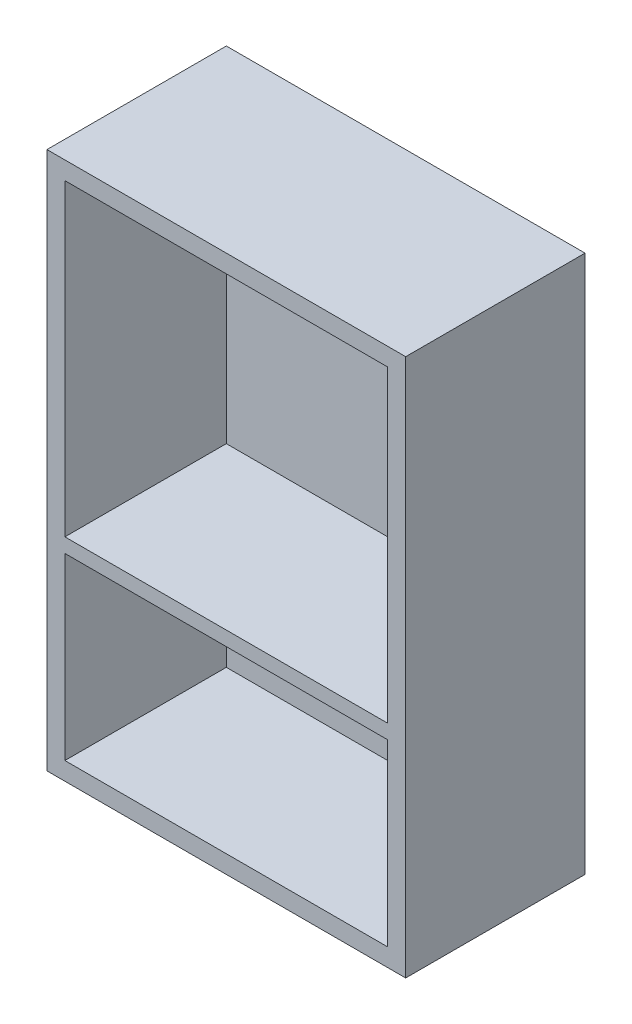
ISO-10303-21;
HEADER;
FILE_DESCRIPTION(('STEP AP214'),'2;1');
FILE_NAME('part.step','',(''),(''),'','','');
FILE_SCHEMA(('AUTOMOTIVE_DESIGN { 1 0 10303 214 1 1 1 1 }'));
ENDSEC;
DATA;
#1=APPLICATION_CONTEXT('core data for automotive mechanical design processes');
#2=APPLICATION_PROTOCOL_DEFINITION('international standard','automotive_design',2000,#1);
#3=PRODUCT_CONTEXT('',#1,'mechanical');
#4=PRODUCT('Part','Part','',(#3));
#5=PRODUCT_RELATED_PRODUCT_CATEGORY('part','',(#4));
#6=PRODUCT_DEFINITION_FORMATION('','',#4);
#7=PRODUCT_DEFINITION_CONTEXT('part definition',#1,'design');
#8=PRODUCT_DEFINITION('design','',#6,#7);
#9=PRODUCT_DEFINITION_SHAPE('','',#8);
#10=(LENGTH_UNIT() NAMED_UNIT(*) SI_UNIT(.MILLI.,.METRE.));
#11=(NAMED_UNIT(*) PLANE_ANGLE_UNIT() SI_UNIT($,.RADIAN.));
#12=(NAMED_UNIT(*) SI_UNIT($,.STERADIAN.) SOLID_ANGLE_UNIT());
#13=UNCERTAINTY_MEASURE_WITH_UNIT(LENGTH_MEASURE(1.E-05),#10,'distance_accuracy_value','');
#14=(GEOMETRIC_REPRESENTATION_CONTEXT(3) GLOBAL_UNCERTAINTY_ASSIGNED_CONTEXT((#13)) GLOBAL_UNIT_ASSIGNED_CONTEXT((#10,
#11,#12)) REPRESENTATION_CONTEXT('',''));
#15=CARTESIAN_POINT('',(0.,0.,0.));
#16=DIRECTION('',(0.,0.,1.));
#17=DIRECTION('',(1.,0.,0.));
#18=AXIS2_PLACEMENT_3D('',#15,#16,#17);
#19=CARTESIAN_POINT('',(50.,75.,5.));
#20=DIRECTION('',(-1.,0.,0.));
#21=DIRECTION('',(0.,-1.,0.));
#22=AXIS2_PLACEMENT_3D('',#19,#20,#21);
#23=PLANE('',#22);
#24=DIRECTION('',(0.,1.,0.));
#25=VECTOR('',#24,1.);
#26=CARTESIAN_POINT('',(50.,75.,0.));
#27=LINE('',#26,#25);
#28=CARTESIAN_POINT('',(50.,-75.,0.));
#29=VERTEX_POINT('',#28);
#30=CARTESIAN_POINT('',(50.,75.,0.));
#31=VERTEX_POINT('',#30);
#32=EDGE_CURVE('E198',#29,#31,#27,.T.);
#33=ORIENTED_EDGE('',*,*,#32,.T.);
#34=DIRECTION('',(0.,0.,-1.));
#35=VECTOR('',#34,1.);
#36=CARTESIAN_POINT('',(50.,75.,5.));
#37=LINE('',#36,#35);
#38=CARTESIAN_POINT('',(50.,75.,50.));
#39=VERTEX_POINT('',#38);
#40=EDGE_CURVE('E11',#39,#31,#37,.T.);
#41=ORIENTED_EDGE('',*,*,#40,.F.);
#42=DIRECTION('',(0.,1.,0.));
#43=VECTOR('',#42,1.);
#44=CARTESIAN_POINT('',(50.,-75.,50.));
#45=LINE('',#44,#43);
#46=CARTESIAN_POINT('',(50.,-75.,50.));
#47=VERTEX_POINT('',#46);
#48=EDGE_CURVE('E186',#47,#39,#45,.T.);
#49=ORIENTED_EDGE('',*,*,#48,.F.);
#50=DIRECTION('',(0.,0.,-1.));
#51=VECTOR('',#50,1.);
#52=CARTESIAN_POINT('',(50.,-75.,5.));
#53=LINE('',#52,#51);
#54=EDGE_CURVE('E207',#47,#29,#53,.T.);
#55=ORIENTED_EDGE('',*,*,#54,.T.);
#56=EDGE_LOOP('',(#33,#41,#49,#55));
#57=FACE_BOUND('',#56,.T.);
#58=ADVANCED_FACE('F32',(#57),#23,.F.);
#59=CARTESIAN_POINT('',(-50.,75.,5.));
#60=DIRECTION('',(0.,-1.,0.));
#61=DIRECTION('',(0.,0.,-1.));
#62=AXIS2_PLACEMENT_3D('',#59,#60,#61);
#63=PLANE('',#62);
#64=DIRECTION('',(-1.,0.,0.));
#65=VECTOR('',#64,1.);
#66=CARTESIAN_POINT('',(-50.,75.,0.));
#67=LINE('',#66,#65);
#68=CARTESIAN_POINT('',(-50.,75.,0.));
#69=VERTEX_POINT('',#68);
#70=EDGE_CURVE('E201',#31,#69,#67,.T.);
#71=ORIENTED_EDGE('',*,*,#70,.T.);
#72=DIRECTION('',(0.,0.,-1.));
#73=VECTOR('',#72,1.);
#74=CARTESIAN_POINT('',(-50.,75.,5.));
#75=LINE('',#74,#73);
#76=CARTESIAN_POINT('',(-50.,75.,50.));
#77=VERTEX_POINT('',#76);
#78=EDGE_CURVE('E39',#77,#69,#75,.T.);
#79=ORIENTED_EDGE('',*,*,#78,.F.);
#80=DIRECTION('',(-1.,0.,0.));
#81=VECTOR('',#80,1.);
#82=CARTESIAN_POINT('',(-50.,75.,50.));
#83=LINE('',#82,#81);
#84=EDGE_CURVE('E189',#39,#77,#83,.T.);
#85=ORIENTED_EDGE('',*,*,#84,.F.);
#86=ORIENTED_EDGE('',*,*,#40,.T.);
#87=EDGE_LOOP('',(#71,#79,#85,#86));
#88=FACE_BOUND('',#87,.T.);
#89=ADVANCED_FACE('F229',(#88),#63,.F.);
#90=CARTESIAN_POINT('',(-50.,75.,5.));
#91=DIRECTION('',(1.,0.,0.));
#92=DIRECTION('',(0.,1.,0.));
#93=AXIS2_PLACEMENT_3D('',#90,#91,#92);
#94=PLANE('',#93);
#95=DIRECTION('',(0.,-1.,0.));
#96=VECTOR('',#95,1.);
#97=CARTESIAN_POINT('',(-50.,75.,0.));
#98=LINE('',#97,#96);
#99=CARTESIAN_POINT('',(-50.,-75.,0.));
#100=VERTEX_POINT('',#99);
#101=EDGE_CURVE('E203',#69,#100,#98,.T.);
#102=ORIENTED_EDGE('',*,*,#101,.T.);
#103=DIRECTION('',(0.,0.,-1.));
#104=VECTOR('',#103,1.);
#105=CARTESIAN_POINT('',(-50.,-75.,5.));
#106=LINE('',#105,#104);
#107=CARTESIAN_POINT('',(-50.,-75.,50.));
#108=VERTEX_POINT('',#107);
#109=EDGE_CURVE('E210',#108,#100,#106,.T.);
#110=ORIENTED_EDGE('',*,*,#109,.F.);
#111=DIRECTION('',(0.,-1.,0.));
#112=VECTOR('',#111,1.);
#113=CARTESIAN_POINT('',(-50.,-75.,50.));
#114=LINE('',#113,#112);
#115=EDGE_CURVE('E192',#77,#108,#114,.T.);
#116=ORIENTED_EDGE('',*,*,#115,.F.);
#117=ORIENTED_EDGE('',*,*,#78,.T.);
#118=EDGE_LOOP('',(#102,#110,#116,#117));
#119=FACE_BOUND('',#118,.T.);
#120=ADVANCED_FACE('F216',(#119),#94,.F.);
#121=CARTESIAN_POINT('',(-50.,-75.,5.));
#122=DIRECTION('',(0.,1.,0.));
#123=DIRECTION('',(0.,0.,1.));
#124=AXIS2_PLACEMENT_3D('',#121,#122,#123);
#125=PLANE('',#124);
#126=DIRECTION('',(1.,0.,0.));
#127=VECTOR('',#126,1.);
#128=CARTESIAN_POINT('',(-50.,-75.,0.));
#129=LINE('',#128,#127);
#130=EDGE_CURVE('E205',#100,#29,#129,.T.);
#131=ORIENTED_EDGE('',*,*,#130,.T.);
#132=ORIENTED_EDGE('',*,*,#54,.F.);
#133=DIRECTION('',(1.,0.,0.));
#134=VECTOR('',#133,1.);
#135=CARTESIAN_POINT('',(-50.,-75.,50.));
#136=LINE('',#135,#134);
#137=EDGE_CURVE('E195',#108,#47,#136,.T.);
#138=ORIENTED_EDGE('',*,*,#137,.F.);
#139=ORIENTED_EDGE('',*,*,#109,.T.);
#140=EDGE_LOOP('',(#131,#132,#138,#139));
#141=FACE_BOUND('',#140,.T.);
#142=ADVANCED_FACE('F224',(#141),#125,.F.);
#143=CARTESIAN_POINT('',(0.,0.,0.));
#144=DIRECTION('',(0.,0.,1.));
#145=DIRECTION('',(1.,0.,0.));
#146=AXIS2_PLACEMENT_3D('',#143,#144,#145);
#147=PLANE('',#146);
#148=ORIENTED_EDGE('',*,*,#32,.F.);
#149=ORIENTED_EDGE('',*,*,#130,.F.);
#150=ORIENTED_EDGE('',*,*,#101,.F.);
#151=ORIENTED_EDGE('',*,*,#70,.F.);
#152=EDGE_LOOP('',(#148,#149,#150,#151));
#153=FACE_BOUND('',#152,.T.);
#154=ADVANCED_FACE('F222',(#153),#147,.F.);
#155=CARTESIAN_POINT('',(0.,0.,50.));
#156=DIRECTION('',(0.,0.,-1.));
#157=DIRECTION('',(-1.,0.,0.));
#158=AXIS2_PLACEMENT_3D('',#155,#156,#157);
#159=PLANE('',#158);
#160=DIRECTION('',(0.,1.,0.));
#161=VECTOR('',#160,1.);
#162=CARTESIAN_POINT('',(45.,70.,50.));
#163=LINE('',#162,#161);
#164=CARTESIAN_POINT('',(45.,-16.,50.));
#165=VERTEX_POINT('',#164);
#166=CARTESIAN_POINT('',(45.,70.,50.));
#167=VERTEX_POINT('',#166);
#168=EDGE_CURVE('E160',#165,#167,#163,.T.);
#169=ORIENTED_EDGE('',*,*,#168,.F.);
#170=DIRECTION('',(1.,0.,0.));
#171=VECTOR('',#170,1.);
#172=CARTESIAN_POINT('',(-45.,-16.,50.));
#173=LINE('',#172,#171);
#174=CARTESIAN_POINT('',(-45.,-16.,50.));
#175=VERTEX_POINT('',#174);
#176=EDGE_CURVE('E168',#175,#165,#173,.T.);
#177=ORIENTED_EDGE('',*,*,#176,.F.);
#178=DIRECTION('',(0.,-1.,0.));
#179=VECTOR('',#178,1.);
#180=CARTESIAN_POINT('',(-45.,70.,50.));
#181=LINE('',#180,#179);
#182=CARTESIAN_POINT('',(-45.,70.,50.));
#183=VERTEX_POINT('',#182);
#184=EDGE_CURVE('E165',#183,#175,#181,.T.);
#185=ORIENTED_EDGE('',*,*,#184,.F.);
#186=DIRECTION('',(-1.,0.,0.));
#187=VECTOR('',#186,1.);
#188=CARTESIAN_POINT('',(-45.,70.,50.));
#189=LINE('',#188,#187);
#190=EDGE_CURVE('E162',#167,#183,#189,.T.);
#191=ORIENTED_EDGE('',*,*,#190,.F.);
#192=EDGE_LOOP('',(#169,#177,#185,#191));
#193=FACE_BOUND('',#192,.T.);
#194=ORIENTED_EDGE('',*,*,#48,.T.);
#195=ORIENTED_EDGE('',*,*,#84,.T.);
#196=ORIENTED_EDGE('',*,*,#115,.T.);
#197=ORIENTED_EDGE('',*,*,#137,.T.);
#198=EDGE_LOOP('',(#194,#195,#196,#197));
#199=FACE_BOUND('',#198,.T.);
#200=DIRECTION('',(0.,1.,0.));
#201=VECTOR('',#200,1.);
#202=CARTESIAN_POINT('',(45.,-70.,50.));
#203=LINE('',#202,#201);
#204=CARTESIAN_POINT('',(45.,-70.,50.));
#205=VERTEX_POINT('',#204);
#206=CARTESIAN_POINT('',(45.,-20.,50.));
#207=VERTEX_POINT('',#206);
#208=EDGE_CURVE('E119',#205,#207,#203,.T.);
#209=ORIENTED_EDGE('',*,*,#208,.F.);
#210=DIRECTION('',(1.,0.,0.));
#211=VECTOR('',#210,1.);
#212=CARTESIAN_POINT('',(-45.,-70.,50.));
#213=LINE('',#212,#211);
#214=CARTESIAN_POINT('',(-45.,-70.,50.));
#215=VERTEX_POINT('',#214);
#216=EDGE_CURVE('E145',#215,#205,#213,.T.);
#217=ORIENTED_EDGE('',*,*,#216,.F.);
#218=DIRECTION('',(0.,-1.,0.));
#219=VECTOR('',#218,1.);
#220=CARTESIAN_POINT('',(-45.,-70.,50.));
#221=LINE('',#220,#219);
#222=CARTESIAN_POINT('',(-45.,-20.,50.));
#223=VERTEX_POINT('',#222);
#224=EDGE_CURVE('E143',#223,#215,#221,.T.);
#225=ORIENTED_EDGE('',*,*,#224,.F.);
#226=DIRECTION('',(-1.,0.,0.));
#227=VECTOR('',#226,1.);
#228=CARTESIAN_POINT('',(-45.,-20.,50.));
#229=LINE('',#228,#227);
#230=EDGE_CURVE('E129',#207,#223,#229,.T.);
#231=ORIENTED_EDGE('',*,*,#230,.F.);
#232=EDGE_LOOP('',(#209,#217,#225,#231));
#233=FACE_BOUND('',#232,.T.);
#234=ADVANCED_FACE('F141',(#193,#199,#233),#159,.F.);
#235=CARTESIAN_POINT('',(45.,70.,50.));
#236=DIRECTION('',(-1.,0.,0.));
#237=DIRECTION('',(0.,-1.,0.));
#238=AXIS2_PLACEMENT_3D('',#235,#236,#237);
#239=PLANE('',#238);
#240=DIRECTION('',(0.,1.,0.));
#241=VECTOR('',#240,1.);
#242=CARTESIAN_POINT('',(45.,70.,5.));
#243=LINE('',#242,#241);
#244=CARTESIAN_POINT('',(45.,-16.,5.));
#245=VERTEX_POINT('',#244);
#246=CARTESIAN_POINT('',(45.,70.,5.));
#247=VERTEX_POINT('',#246);
#248=EDGE_CURVE('E46',#245,#247,#243,.T.);
#249=ORIENTED_EDGE('',*,*,#248,.F.);
#250=DIRECTION('',(0.,0.,-1.));
#251=VECTOR('',#250,1.);
#252=CARTESIAN_POINT('',(45.,-16.,50.));
#253=LINE('',#252,#251);
#254=EDGE_CURVE('E170',#165,#245,#253,.T.);
#255=ORIENTED_EDGE('',*,*,#254,.F.);
#256=ORIENTED_EDGE('',*,*,#168,.T.);
#257=DIRECTION('',(0.,0.,-1.));
#258=VECTOR('',#257,1.);
#259=CARTESIAN_POINT('',(45.,70.,50.));
#260=LINE('',#259,#258);
#261=EDGE_CURVE('E183',#167,#247,#260,.T.);
#262=ORIENTED_EDGE('',*,*,#261,.T.);
#263=EDGE_LOOP('',(#249,#255,#256,#262));
#264=FACE_BOUND('',#263,.T.);
#265=ADVANCED_FACE('F249',(#264),#239,.T.);
#266=CARTESIAN_POINT('',(-45.,70.,50.));
#267=DIRECTION('',(0.,-1.,0.));
#268=DIRECTION('',(0.,0.,-1.));
#269=AXIS2_PLACEMENT_3D('',#266,#267,#268);
#270=PLANE('',#269);
#271=DIRECTION('',(-1.,0.,0.));
#272=VECTOR('',#271,1.);
#273=CARTESIAN_POINT('',(-45.,70.,5.));
#274=LINE('',#273,#272);
#275=CARTESIAN_POINT('',(-45.,70.,5.));
#276=VERTEX_POINT('',#275);
#277=EDGE_CURVE('E50',#247,#276,#274,.T.);
#278=ORIENTED_EDGE('',*,*,#277,.F.);
#279=ORIENTED_EDGE('',*,*,#261,.F.);
#280=ORIENTED_EDGE('',*,*,#190,.T.);
#281=DIRECTION('',(0.,0.,-1.));
#282=VECTOR('',#281,1.);
#283=CARTESIAN_POINT('',(-45.,70.,50.));
#284=LINE('',#283,#282);
#285=EDGE_CURVE('E181',#183,#276,#284,.T.);
#286=ORIENTED_EDGE('',*,*,#285,.T.);
#287=EDGE_LOOP('',(#278,#279,#280,#286));
#288=FACE_BOUND('',#287,.T.);
#289=ADVANCED_FACE('F253',(#288),#270,.T.);
#290=CARTESIAN_POINT('',(-45.,70.,50.));
#291=DIRECTION('',(1.,0.,0.));
#292=DIRECTION('',(0.,1.,0.));
#293=AXIS2_PLACEMENT_3D('',#290,#291,#292);
#294=PLANE('',#293);
#295=DIRECTION('',(0.,-1.,0.));
#296=VECTOR('',#295,1.);
#297=CARTESIAN_POINT('',(-45.,70.,5.));
#298=LINE('',#297,#296);
#299=CARTESIAN_POINT('',(-45.,-16.,5.));
#300=VERTEX_POINT('',#299);
#301=EDGE_CURVE('E173',#276,#300,#298,.T.);
#302=ORIENTED_EDGE('',*,*,#301,.F.);
#303=ORIENTED_EDGE('',*,*,#285,.F.);
#304=ORIENTED_EDGE('',*,*,#184,.T.);
#305=DIRECTION('',(0.,0.,-1.));
#306=VECTOR('',#305,1.);
#307=CARTESIAN_POINT('',(-45.,-16.,50.));
#308=LINE('',#307,#306);
#309=EDGE_CURVE('E178',#175,#300,#308,.T.);
#310=ORIENTED_EDGE('',*,*,#309,.T.);
#311=EDGE_LOOP('',(#302,#303,#304,#310));
#312=FACE_BOUND('',#311,.T.);
#313=ADVANCED_FACE('F257',(#312),#294,.T.);
#314=CARTESIAN_POINT('',(-45.,-16.,50.));
#315=DIRECTION('',(0.,1.,0.));
#316=DIRECTION('',(0.,0.,1.));
#317=AXIS2_PLACEMENT_3D('',#314,#315,#316);
#318=PLANE('',#317);
#319=DIRECTION('',(1.,0.,0.));
#320=VECTOR('',#319,1.);
#321=CARTESIAN_POINT('',(-45.,-16.,5.));
#322=LINE('',#321,#320);
#323=EDGE_CURVE('E163',#300,#245,#322,.T.);
#324=ORIENTED_EDGE('',*,*,#323,.F.);
#325=ORIENTED_EDGE('',*,*,#309,.F.);
#326=ORIENTED_EDGE('',*,*,#176,.T.);
#327=ORIENTED_EDGE('',*,*,#254,.T.);
#328=EDGE_LOOP('',(#324,#325,#326,#327));
#329=FACE_BOUND('',#328,.T.);
#330=ADVANCED_FACE('F261',(#329),#318,.T.);
#331=CARTESIAN_POINT('',(45.,-70.,50.));
#332=DIRECTION('',(-1.,0.,0.));
#333=DIRECTION('',(0.,0.,1.));
#334=AXIS2_PLACEMENT_3D('',#331,#332,#333);
#335=PLANE('',#334);
#336=DIRECTION('',(0.,1.,0.));
#337=VECTOR('',#336,1.);
#338=CARTESIAN_POINT('',(45.,-70.,5.));
#339=LINE('',#338,#337);
#340=CARTESIAN_POINT('',(45.,-70.,5.));
#341=VERTEX_POINT('',#340);
#342=CARTESIAN_POINT('',(45.,-20.,5.));
#343=VERTEX_POINT('',#342);
#344=EDGE_CURVE('E149',#341,#343,#339,.T.);
#345=ORIENTED_EDGE('',*,*,#344,.F.);
#346=DIRECTION('',(0.,0.,-1.));
#347=VECTOR('',#346,1.);
#348=CARTESIAN_POINT('',(45.,-70.,50.));
#349=LINE('',#348,#347);
#350=EDGE_CURVE('E125',#205,#341,#349,.T.);
#351=ORIENTED_EDGE('',*,*,#350,.F.);
#352=ORIENTED_EDGE('',*,*,#208,.T.);
#353=DIRECTION('',(0.,0.,-1.));
#354=VECTOR('',#353,1.);
#355=CARTESIAN_POINT('',(45.,-20.,50.));
#356=LINE('',#355,#354);
#357=EDGE_CURVE('E123',#207,#343,#356,.T.);
#358=ORIENTED_EDGE('',*,*,#357,.T.);
#359=EDGE_LOOP('',(#345,#351,#352,#358));
#360=FACE_BOUND('',#359,.T.);
#361=ADVANCED_FACE('F122',(#360),#335,.T.);
#362=CARTESIAN_POINT('',(-45.,-20.,50.));
#363=DIRECTION('',(0.,-1.,0.));
#364=DIRECTION('',(0.,0.,-1.));
#365=AXIS2_PLACEMENT_3D('',#362,#363,#364);
#366=PLANE('',#365);
#367=DIRECTION('',(-1.,0.,0.));
#368=VECTOR('',#367,1.);
#369=CARTESIAN_POINT('',(-45.,-20.,5.));
#370=LINE('',#369,#368);
#371=CARTESIAN_POINT('',(-45.,-20.,5.));
#372=VERTEX_POINT('',#371);
#373=EDGE_CURVE('E137',#343,#372,#370,.T.);
#374=ORIENTED_EDGE('',*,*,#373,.F.);
#375=ORIENTED_EDGE('',*,*,#357,.F.);
#376=ORIENTED_EDGE('',*,*,#230,.T.);
#377=DIRECTION('',(0.,0.,-1.));
#378=VECTOR('',#377,1.);
#379=CARTESIAN_POINT('',(-45.,-20.,50.));
#380=LINE('',#379,#378);
#381=EDGE_CURVE('E138',#223,#372,#380,.T.);
#382=ORIENTED_EDGE('',*,*,#381,.T.);
#383=EDGE_LOOP('',(#374,#375,#376,#382));
#384=FACE_BOUND('',#383,.T.);
#385=ADVANCED_FACE('F134',(#384),#366,.T.);
#386=CARTESIAN_POINT('',(-45.,-70.,50.));
#387=DIRECTION('',(1.,0.,0.));
#388=DIRECTION('',(0.,0.,-1.));
#389=AXIS2_PLACEMENT_3D('',#386,#387,#388);
#390=PLANE('',#389);
#391=DIRECTION('',(0.,-1.,0.));
#392=VECTOR('',#391,1.);
#393=CARTESIAN_POINT('',(-45.,-70.,5.));
#394=LINE('',#393,#392);
#395=CARTESIAN_POINT('',(-45.,-70.,5.));
#396=VERTEX_POINT('',#395);
#397=EDGE_CURVE('E152',#372,#396,#394,.T.);
#398=ORIENTED_EDGE('',*,*,#397,.F.);
#399=ORIENTED_EDGE('',*,*,#381,.F.);
#400=ORIENTED_EDGE('',*,*,#224,.T.);
#401=DIRECTION('',(0.,0.,-1.));
#402=VECTOR('',#401,1.);
#403=CARTESIAN_POINT('',(-45.,-70.,50.));
#404=LINE('',#403,#402);
#405=EDGE_CURVE('E156',#215,#396,#404,.T.);
#406=ORIENTED_EDGE('',*,*,#405,.T.);
#407=EDGE_LOOP('',(#398,#399,#400,#406));
#408=FACE_BOUND('',#407,.T.);
#409=ADVANCED_FACE('F270',(#408),#390,.T.);
#410=CARTESIAN_POINT('',(-45.,-70.,50.));
#411=DIRECTION('',(0.,1.,0.));
#412=DIRECTION('',(0.,0.,1.));
#413=AXIS2_PLACEMENT_3D('',#410,#411,#412);
#414=PLANE('',#413);
#415=DIRECTION('',(1.,0.,0.));
#416=VECTOR('',#415,1.);
#417=CARTESIAN_POINT('',(-45.,-70.,5.));
#418=LINE('',#417,#416);
#419=EDGE_CURVE('E130',#396,#341,#418,.T.);
#420=ORIENTED_EDGE('',*,*,#419,.F.);
#421=ORIENTED_EDGE('',*,*,#405,.F.);
#422=ORIENTED_EDGE('',*,*,#216,.T.);
#423=ORIENTED_EDGE('',*,*,#350,.T.);
#424=EDGE_LOOP('',(#420,#421,#422,#423));
#425=FACE_BOUND('',#424,.T.);
#426=ADVANCED_FACE('F245',(#425),#414,.T.);
#427=CARTESIAN_POINT('',(0.,0.,5.));
#428=DIRECTION('',(0.,0.,1.));
#429=DIRECTION('',(1.,0.,0.));
#430=AXIS2_PLACEMENT_3D('',#427,#428,#429);
#431=PLANE('',#430);
#432=ORIENTED_EDGE('',*,*,#344,.T.);
#433=ORIENTED_EDGE('',*,*,#373,.T.);
#434=ORIENTED_EDGE('',*,*,#397,.T.);
#435=ORIENTED_EDGE('',*,*,#419,.T.);
#436=EDGE_LOOP('',(#432,#433,#434,#435));
#437=FACE_BOUND('',#436,.T.);
#438=ADVANCED_FACE('F241',(#437),#431,.T.);
#439=ORIENTED_EDGE('',*,*,#248,.T.);
#440=ORIENTED_EDGE('',*,*,#277,.T.);
#441=ORIENTED_EDGE('',*,*,#301,.T.);
#442=ORIENTED_EDGE('',*,*,#323,.T.);
#443=EDGE_LOOP('',(#439,#440,#441,#442));
#444=FACE_BOUND('',#443,.T.);
#445=ADVANCED_FACE('F244',(#444),#431,.T.);
#446=CLOSED_SHELL('',(#58,#89,#120,#142,#154,#234,#265,#289,#313,#330,#361,#385,#409,#426,#438,#445));
#447=MANIFOLD_SOLID_BREP('B2',#446);
#448=ADVANCED_BREP_SHAPE_REPRESENTATION('',(#18,#447),#14);
#449=SHAPE_DEFINITION_REPRESENTATION(#9,#448);
ENDSEC;
END-ISO-10303-21;
